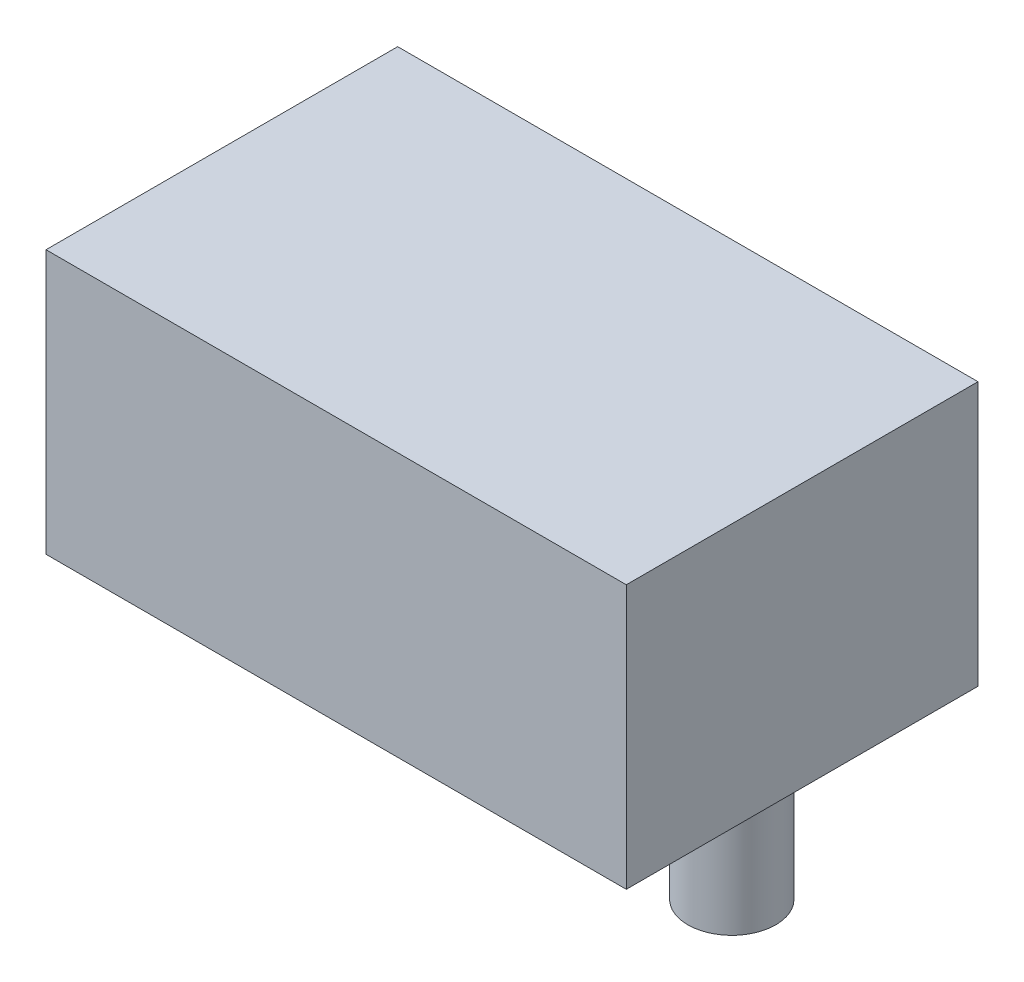
ISO-10303-21;
HEADER;
FILE_DESCRIPTION(('STEP AP214'),'2;1');
FILE_NAME('part.step','',(''),(''),'','','');
FILE_SCHEMA(('AUTOMOTIVE_DESIGN { 1 0 10303 214 1 1 1 1 }'));
ENDSEC;
DATA;
#1=APPLICATION_CONTEXT('core data for automotive mechanical design processes');
#2=APPLICATION_PROTOCOL_DEFINITION('international standard','automotive_design',2000,#1);
#3=PRODUCT_CONTEXT('',#1,'mechanical');
#4=PRODUCT('Part','Part','',(#3));
#5=PRODUCT_RELATED_PRODUCT_CATEGORY('part','',(#4));
#6=PRODUCT_DEFINITION_FORMATION('','',#4);
#7=PRODUCT_DEFINITION_CONTEXT('part definition',#1,'design');
#8=PRODUCT_DEFINITION('design','',#6,#7);
#9=PRODUCT_DEFINITION_SHAPE('','',#8);
#10=(LENGTH_UNIT() NAMED_UNIT(*) SI_UNIT(.MILLI.,.METRE.));
#11=(NAMED_UNIT(*) PLANE_ANGLE_UNIT() SI_UNIT($,.RADIAN.));
#12=(NAMED_UNIT(*) SI_UNIT($,.STERADIAN.) SOLID_ANGLE_UNIT());
#13=UNCERTAINTY_MEASURE_WITH_UNIT(LENGTH_MEASURE(1.E-05),#10,'distance_accuracy_value','');
#14=(GEOMETRIC_REPRESENTATION_CONTEXT(3) GLOBAL_UNCERTAINTY_ASSIGNED_CONTEXT((#13)) GLOBAL_UNIT_ASSIGNED_CONTEXT((#10,
#11,#12)) REPRESENTATION_CONTEXT('',''));
#15=CARTESIAN_POINT('',(0.,0.,0.));
#16=DIRECTION('',(0.,0.,1.));
#17=DIRECTION('',(1.,0.,0.));
#18=AXIS2_PLACEMENT_3D('',#15,#16,#17);
#19=CARTESIAN_POINT('',(20.955,19.05,0.));
#20=DIRECTION('',(1.,0.,0.));
#21=DIRECTION('',(0.,0.,-1.));
#22=AXIS2_PLACEMENT_3D('',#19,#20,#21);
#23=PLANE('',#22);
#24=DIRECTION('',(0.,0.,1.));
#25=VECTOR('',#24,1.);
#26=CARTESIAN_POINT('',(20.955,0.,0.));
#27=LINE('',#26,#25);
#28=CARTESIAN_POINT('',(20.955,0.,-12.7));
#29=VERTEX_POINT('',#28);
#30=CARTESIAN_POINT('',(20.955,0.,12.7));
#31=VERTEX_POINT('',#30);
#32=EDGE_CURVE('E98',#29,#31,#27,.T.);
#33=ORIENTED_EDGE('',*,*,#32,.F.);
#34=DIRECTION('',(0.,-1.,0.));
#35=VECTOR('',#34,1.);
#36=CARTESIAN_POINT('',(20.955,19.05,-12.7));
#37=LINE('',#36,#35);
#38=CARTESIAN_POINT('',(20.955,19.05,-12.7));
#39=VERTEX_POINT('',#38);
#40=EDGE_CURVE('E11',#39,#29,#37,.T.);
#41=ORIENTED_EDGE('',*,*,#40,.F.);
#42=DIRECTION('',(0.,0.,1.));
#43=VECTOR('',#42,1.);
#44=CARTESIAN_POINT('',(20.955,19.05,0.));
#45=LINE('',#44,#43);
#46=CARTESIAN_POINT('',(20.955,19.05,12.7));
#47=VERTEX_POINT('',#46);
#48=EDGE_CURVE('E91',#39,#47,#45,.T.);
#49=ORIENTED_EDGE('',*,*,#48,.T.);
#50=DIRECTION('',(0.,-1.,0.));
#51=VECTOR('',#50,1.);
#52=CARTESIAN_POINT('',(20.955,19.05,12.7));
#53=LINE('',#52,#51);
#54=EDGE_CURVE('E72',#47,#31,#53,.T.);
#55=ORIENTED_EDGE('',*,*,#54,.T.);
#56=EDGE_LOOP('',(#33,#41,#49,#55));
#57=FACE_BOUND('',#56,.T.);
#58=ADVANCED_FACE('F34',(#57),#23,.T.);
#59=CARTESIAN_POINT('',(0.,19.05,-12.7));
#60=DIRECTION('',(0.,0.,-1.));
#61=DIRECTION('',(-1.,0.,0.));
#62=AXIS2_PLACEMENT_3D('',#59,#60,#61);
#63=PLANE('',#62);
#64=DIRECTION('',(1.,0.,0.));
#65=VECTOR('',#64,1.);
#66=CARTESIAN_POINT('',(0.,0.,-12.7));
#67=LINE('',#66,#65);
#68=CARTESIAN_POINT('',(-20.955,0.,-12.7));
#69=VERTEX_POINT('',#68);
#70=EDGE_CURVE('E85',#69,#29,#67,.T.);
#71=ORIENTED_EDGE('',*,*,#70,.F.);
#72=DIRECTION('',(0.,-1.,0.));
#73=VECTOR('',#72,1.);
#74=CARTESIAN_POINT('',(-20.955,19.05,-12.7));
#75=LINE('',#74,#73);
#76=CARTESIAN_POINT('',(-20.955,19.05,-12.7));
#77=VERTEX_POINT('',#76);
#78=EDGE_CURVE('E42',#77,#69,#75,.T.);
#79=ORIENTED_EDGE('',*,*,#78,.F.);
#80=DIRECTION('',(1.,0.,0.));
#81=VECTOR('',#80,1.);
#82=CARTESIAN_POINT('',(0.,19.05,-12.7));
#83=LINE('',#82,#81);
#84=EDGE_CURVE('E83',#77,#39,#83,.T.);
#85=ORIENTED_EDGE('',*,*,#84,.T.);
#86=ORIENTED_EDGE('',*,*,#40,.T.);
#87=EDGE_LOOP('',(#71,#79,#85,#86));
#88=FACE_BOUND('',#87,.T.);
#89=ADVANCED_FACE('F81',(#88),#63,.T.);
#90=CARTESIAN_POINT('',(-20.955,19.05,0.));
#91=DIRECTION('',(1.,0.,0.));
#92=DIRECTION('',(0.,0.,-1.));
#93=AXIS2_PLACEMENT_3D('',#90,#91,#92);
#94=PLANE('',#93);
#95=DIRECTION('',(0.,0.,1.));
#96=VECTOR('',#95,1.);
#97=CARTESIAN_POINT('',(-20.955,0.,0.));
#98=LINE('',#97,#96);
#99=CARTESIAN_POINT('',(-20.955,0.,12.7));
#100=VERTEX_POINT('',#99);
#101=EDGE_CURVE('E65',#69,#100,#98,.T.);
#102=ORIENTED_EDGE('',*,*,#101,.T.);
#103=DIRECTION('',(0.,-1.,0.));
#104=VECTOR('',#103,1.);
#105=CARTESIAN_POINT('',(-20.955,19.05,12.7));
#106=LINE('',#105,#104);
#107=CARTESIAN_POINT('',(-20.955,19.05,12.7));
#108=VERTEX_POINT('',#107);
#109=EDGE_CURVE('E86',#108,#100,#106,.T.);
#110=ORIENTED_EDGE('',*,*,#109,.F.);
#111=DIRECTION('',(0.,0.,1.));
#112=VECTOR('',#111,1.);
#113=CARTESIAN_POINT('',(-20.955,19.05,0.));
#114=LINE('',#113,#112);
#115=EDGE_CURVE('E87',#77,#108,#114,.T.);
#116=ORIENTED_EDGE('',*,*,#115,.F.);
#117=ORIENTED_EDGE('',*,*,#78,.T.);
#118=EDGE_LOOP('',(#102,#110,#116,#117));
#119=FACE_BOUND('',#118,.T.);
#120=ADVANCED_FACE('F88',(#119),#94,.F.);
#121=CARTESIAN_POINT('',(0.,19.05,12.7));
#122=DIRECTION('',(0.,0.,-1.));
#123=DIRECTION('',(-1.,0.,0.));
#124=AXIS2_PLACEMENT_3D('',#121,#122,#123);
#125=PLANE('',#124);
#126=DIRECTION('',(1.,0.,0.));
#127=VECTOR('',#126,1.);
#128=CARTESIAN_POINT('',(0.,0.,12.7));
#129=LINE('',#128,#127);
#130=EDGE_CURVE('E93',#100,#31,#129,.T.);
#131=ORIENTED_EDGE('',*,*,#130,.T.);
#132=ORIENTED_EDGE('',*,*,#54,.F.);
#133=DIRECTION('',(1.,0.,0.));
#134=VECTOR('',#133,1.);
#135=CARTESIAN_POINT('',(0.,19.05,12.7));
#136=LINE('',#135,#134);
#137=EDGE_CURVE('E50',#108,#47,#136,.T.);
#138=ORIENTED_EDGE('',*,*,#137,.F.);
#139=ORIENTED_EDGE('',*,*,#109,.T.);
#140=EDGE_LOOP('',(#131,#132,#138,#139));
#141=FACE_BOUND('',#140,.T.);
#142=ADVANCED_FACE('F108',(#141),#125,.F.);
#143=CARTESIAN_POINT('',(0.,19.05,0.));
#144=DIRECTION('',(0.,1.,0.));
#145=DIRECTION('',(0.,0.,1.));
#146=AXIS2_PLACEMENT_3D('',#143,#144,#145);
#147=PLANE('',#146);
#148=ORIENTED_EDGE('',*,*,#48,.F.);
#149=ORIENTED_EDGE('',*,*,#84,.F.);
#150=ORIENTED_EDGE('',*,*,#115,.T.);
#151=ORIENTED_EDGE('',*,*,#137,.T.);
#152=EDGE_LOOP('',(#148,#149,#150,#151));
#153=FACE_BOUND('',#152,.T.);
#154=ADVANCED_FACE('F90',(#153),#147,.T.);
#155=CARTESIAN_POINT('',(0.,0.,0.));
#156=DIRECTION('',(0.,1.,0.));
#157=DIRECTION('',(0.,0.,1.));
#158=AXIS2_PLACEMENT_3D('',#155,#156,#157);
#159=PLANE('',#158);
#160=CARTESIAN_POINT('',(-15.875,0.,0.));
#161=DIRECTION('',(0.,1.,0.));
#162=DIRECTION('',(0.,0.,1.));
#163=AXIS2_PLACEMENT_3D('',#160,#161,#162);
#164=CIRCLE('',#163,3.175);
#165=CARTESIAN_POINT('',(-15.875,0.,3.175));
#166=VERTEX_POINT('',#165);
#167=EDGE_CURVE('E158',#166,#166,#164,.T.);
#168=ORIENTED_EDGE('',*,*,#167,.T.);
#169=EDGE_LOOP('',(#168));
#170=FACE_BOUND('',#169,.T.);
#171=CARTESIAN_POINT('',(15.875,0.,0.));
#172=DIRECTION('',(0.,1.,0.));
#173=DIRECTION('',(0.,0.,1.));
#174=AXIS2_PLACEMENT_3D('',#171,#172,#173);
#175=CIRCLE('',#174,3.17500000000001);
#176=CARTESIAN_POINT('',(15.875,0.,3.17500000000001));
#177=VERTEX_POINT('',#176);
#178=EDGE_CURVE('E159',#177,#177,#175,.T.);
#179=ORIENTED_EDGE('',*,*,#178,.T.);
#180=EDGE_LOOP('',(#179));
#181=FACE_BOUND('',#180,.T.);
#182=CARTESIAN_POINT('',(0.,0.,0.));
#183=DIRECTION('',(0.,1.,0.));
#184=DIRECTION('',(0.,0.,1.));
#185=AXIS2_PLACEMENT_3D('',#182,#183,#184);
#186=CIRCLE('',#185,6.2865);
#187=CARTESIAN_POINT('',(0.,0.,6.2865));
#188=VERTEX_POINT('',#187);
#189=EDGE_CURVE('E167',#188,#188,#186,.T.);
#190=ORIENTED_EDGE('',*,*,#189,.T.);
#191=EDGE_LOOP('',(#190));
#192=FACE_BOUND('',#191,.T.);
#193=ORIENTED_EDGE('',*,*,#32,.T.);
#194=ORIENTED_EDGE('',*,*,#130,.F.);
#195=ORIENTED_EDGE('',*,*,#101,.F.);
#196=ORIENTED_EDGE('',*,*,#70,.T.);
#197=EDGE_LOOP('',(#193,#194,#195,#196));
#198=FACE_BOUND('',#197,.T.);
#199=ADVANCED_FACE('F110',(#170,#181,#192,#198),#159,.F.);
#200=CARTESIAN_POINT('',(0.,9.525,0.));
#201=DIRECTION('',(0.,-1.,0.));
#202=DIRECTION('',(0.,0.,-1.));
#203=AXIS2_PLACEMENT_3D('',#200,#201,#202);
#204=CYLINDRICAL_SURFACE('',#203,6.2865);
#205=CARTESIAN_POINT('',(0.,9.525,0.));
#206=DIRECTION('',(0.,1.,0.));
#207=DIRECTION('',(0.,0.,1.));
#208=AXIS2_PLACEMENT_3D('',#205,#206,#207);
#209=CIRCLE('',#208,6.2865);
#210=CARTESIAN_POINT('',(0.,9.525,6.2865));
#211=VERTEX_POINT('',#210);
#212=EDGE_CURVE('E101',#211,#211,#209,.T.);
#213=ORIENTED_EDGE('',*,*,#212,.T.);
#214=EDGE_LOOP('',(#213));
#215=FACE_BOUND('',#214,.T.);
#216=ORIENTED_EDGE('',*,*,#189,.F.);
#217=EDGE_LOOP('',(#216));
#218=FACE_BOUND('',#217,.T.);
#219=ADVANCED_FACE('F124',(#215,#218),#204,.F.);
#220=CARTESIAN_POINT('',(0.,9.525,0.));
#221=DIRECTION('',(0.,1.,0.));
#222=DIRECTION('',(0.,0.,1.));
#223=AXIS2_PLACEMENT_3D('',#220,#221,#222);
#224=PLANE('',#223);
#225=ORIENTED_EDGE('',*,*,#212,.F.);
#226=EDGE_LOOP('',(#225));
#227=FACE_BOUND('',#226,.T.);
#228=ADVANCED_FACE('F130',(#227),#224,.F.);
#229=CARTESIAN_POINT('',(15.875,-9.525,0.));
#230=DIRECTION('',(0.,1.,0.));
#231=DIRECTION('',(0.,0.,1.));
#232=AXIS2_PLACEMENT_3D('',#229,#230,#231);
#233=CYLINDRICAL_SURFACE('',#232,3.17500000000001);
#234=CARTESIAN_POINT('',(15.875,-9.525,0.));
#235=DIRECTION('',(0.,1.,0.));
#236=DIRECTION('',(0.,0.,1.));
#237=AXIS2_PLACEMENT_3D('',#234,#235,#236);
#238=CIRCLE('',#237,3.17500000000001);
#239=CARTESIAN_POINT('',(15.875,-9.525,3.17500000000001));
#240=VERTEX_POINT('',#239);
#241=EDGE_CURVE('E162',#240,#240,#238,.T.);
#242=ORIENTED_EDGE('',*,*,#241,.T.);
#243=EDGE_LOOP('',(#242));
#244=FACE_BOUND('',#243,.T.);
#245=ORIENTED_EDGE('',*,*,#178,.F.);
#246=EDGE_LOOP('',(#245));
#247=FACE_BOUND('',#246,.T.);
#248=ADVANCED_FACE('F134',(#244,#247),#233,.T.);
#249=CARTESIAN_POINT('',(15.875,-9.525,0.));
#250=DIRECTION('',(0.,1.,0.));
#251=DIRECTION('',(0.,0.,1.));
#252=AXIS2_PLACEMENT_3D('',#249,#250,#251);
#253=PLANE('',#252);
#254=ORIENTED_EDGE('',*,*,#241,.F.);
#255=EDGE_LOOP('',(#254));
#256=FACE_BOUND('',#255,.T.);
#257=ADVANCED_FACE('F138',(#256),#253,.F.);
#258=CARTESIAN_POINT('',(-15.875,-9.525,0.));
#259=DIRECTION('',(0.,1.,0.));
#260=DIRECTION('',(0.,0.,1.));
#261=AXIS2_PLACEMENT_3D('',#258,#259,#260);
#262=CYLINDRICAL_SURFACE('',#261,3.175);
#263=CARTESIAN_POINT('',(-15.875,-9.525,0.));
#264=DIRECTION('',(0.,1.,0.));
#265=DIRECTION('',(0.,0.,1.));
#266=AXIS2_PLACEMENT_3D('',#263,#264,#265);
#267=CIRCLE('',#266,3.175);
#268=CARTESIAN_POINT('',(-15.875,-9.525,3.175));
#269=VERTEX_POINT('',#268);
#270=EDGE_CURVE('E155',#269,#269,#267,.T.);
#271=ORIENTED_EDGE('',*,*,#270,.T.);
#272=EDGE_LOOP('',(#271));
#273=FACE_BOUND('',#272,.T.);
#274=ORIENTED_EDGE('',*,*,#167,.F.);
#275=EDGE_LOOP('',(#274));
#276=FACE_BOUND('',#275,.T.);
#277=ADVANCED_FACE('F142',(#273,#276),#262,.T.);
#278=CARTESIAN_POINT('',(-15.875,-9.525,0.));
#279=DIRECTION('',(0.,1.,0.));
#280=DIRECTION('',(0.,0.,1.));
#281=AXIS2_PLACEMENT_3D('',#278,#279,#280);
#282=PLANE('',#281);
#283=ORIENTED_EDGE('',*,*,#270,.F.);
#284=EDGE_LOOP('',(#283));
#285=FACE_BOUND('',#284,.T.);
#286=ADVANCED_FACE('F144',(#285),#282,.F.);
#287=CLOSED_SHELL('',(#58,#89,#120,#142,#154,#199,#219,#228,#248,#257,#277,#286));
#288=MANIFOLD_SOLID_BREP('B2',#287);
#289=ADVANCED_BREP_SHAPE_REPRESENTATION('',(#18,#288),#14);
#290=SHAPE_DEFINITION_REPRESENTATION(#9,#289);
ENDSEC;
END-ISO-10303-21;
